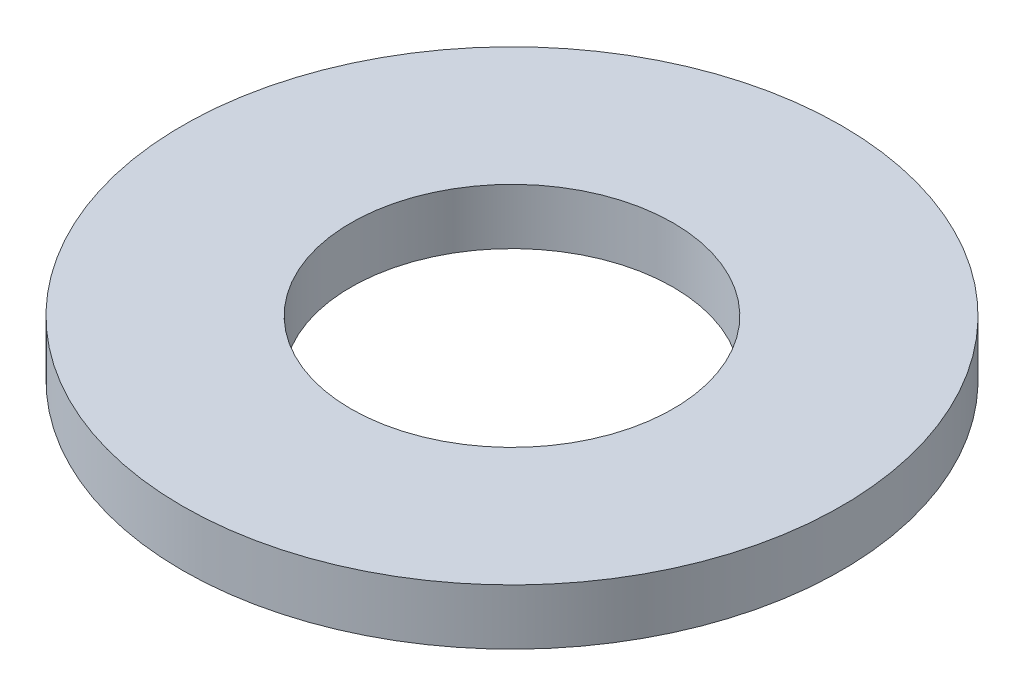
ISO-10303-21;
HEADER;
FILE_DESCRIPTION(('STEP AP214'),'2;1');
FILE_NAME('part.step','',(''),(''),'','','');
FILE_SCHEMA(('AUTOMOTIVE_DESIGN { 1 0 10303 214 1 1 1 1 }'));
ENDSEC;
DATA;
#1=APPLICATION_CONTEXT('core data for automotive mechanical design processes');
#2=APPLICATION_PROTOCOL_DEFINITION('international standard','automotive_design',2000,#1);
#3=PRODUCT_CONTEXT('',#1,'mechanical');
#4=PRODUCT('Part','Part','',(#3));
#5=PRODUCT_RELATED_PRODUCT_CATEGORY('part','',(#4));
#6=PRODUCT_DEFINITION_FORMATION('','',#4);
#7=PRODUCT_DEFINITION_CONTEXT('part definition',#1,'design');
#8=PRODUCT_DEFINITION('design','',#6,#7);
#9=PRODUCT_DEFINITION_SHAPE('','',#8);
#10=(LENGTH_UNIT() NAMED_UNIT(*) SI_UNIT(.MILLI.,.METRE.));
#11=(NAMED_UNIT(*) PLANE_ANGLE_UNIT() SI_UNIT($,.RADIAN.));
#12=(NAMED_UNIT(*) SI_UNIT($,.STERADIAN.) SOLID_ANGLE_UNIT());
#13=UNCERTAINTY_MEASURE_WITH_UNIT(LENGTH_MEASURE(1.E-05),#10,'distance_accuracy_value','');
#14=(GEOMETRIC_REPRESENTATION_CONTEXT(3) GLOBAL_UNCERTAINTY_ASSIGNED_CONTEXT((#13)) GLOBAL_UNIT_ASSIGNED_CONTEXT((#10,
#11,#12)) REPRESENTATION_CONTEXT('',''));
#15=CARTESIAN_POINT('',(0.,0.,0.));
#16=DIRECTION('',(0.,0.,1.));
#17=DIRECTION('',(1.,0.,0.));
#18=AXIS2_PLACEMENT_3D('',#15,#16,#17);
#19=CARTESIAN_POINT('',(0.,0.76,0.));
#20=DIRECTION('',(0.,1.,0.));
#21=DIRECTION('',(0.,0.,1.));
#22=AXIS2_PLACEMENT_3D('',#19,#20,#21);
#23=PLANE('',#22);
#24=CARTESIAN_POINT('',(0.,0.76,0.));
#25=DIRECTION('',(0.,1.,0.));
#26=DIRECTION('',(0.,0.,1.));
#27=AXIS2_PLACEMENT_3D('',#24,#25,#26);
#28=CIRCLE('',#27,4.5);
#29=CARTESIAN_POINT('',(0.,0.76,4.5));
#30=VERTEX_POINT('',#29);
#31=EDGE_CURVE('E10',#30,#30,#28,.T.);
#32=ORIENTED_EDGE('',*,*,#31,.T.);
#33=EDGE_LOOP('',(#32));
#34=FACE_BOUND('',#33,.T.);
#35=CARTESIAN_POINT('',(0.,0.76,0.));
#36=DIRECTION('',(0.,1.,0.));
#37=DIRECTION('',(0.,0.,1.));
#38=AXIS2_PLACEMENT_3D('',#35,#36,#37);
#39=CIRCLE('',#38,2.2);
#40=CARTESIAN_POINT('',(0.,0.76,2.2));
#41=VERTEX_POINT('',#40);
#42=EDGE_CURVE('E48',#41,#41,#39,.T.);
#43=ORIENTED_EDGE('',*,*,#42,.F.);
#44=EDGE_LOOP('',(#43));
#45=FACE_BOUND('',#44,.T.);
#46=ADVANCED_FACE('F37',(#34,#45),#23,.T.);
#47=CARTESIAN_POINT('',(0.,0.,0.));
#48=DIRECTION('',(0.,1.,0.));
#49=DIRECTION('',(0.,0.,1.));
#50=AXIS2_PLACEMENT_3D('',#47,#48,#49);
#51=PLANE('',#50);
#52=CARTESIAN_POINT('',(0.,0.,0.));
#53=DIRECTION('',(0.,1.,0.));
#54=DIRECTION('',(0.,0.,1.));
#55=AXIS2_PLACEMENT_3D('',#52,#53,#54);
#56=CIRCLE('',#55,4.5);
#57=CARTESIAN_POINT('',(0.,0.,4.5));
#58=VERTEX_POINT('',#57);
#59=EDGE_CURVE('E41',#58,#58,#56,.T.);
#60=ORIENTED_EDGE('',*,*,#59,.F.);
#61=EDGE_LOOP('',(#60));
#62=FACE_BOUND('',#61,.T.);
#63=CARTESIAN_POINT('',(0.,0.,0.));
#64=DIRECTION('',(0.,1.,0.));
#65=DIRECTION('',(0.,0.,1.));
#66=AXIS2_PLACEMENT_3D('',#63,#64,#65);
#67=CIRCLE('',#66,2.2);
#68=CARTESIAN_POINT('',(0.,0.,2.2));
#69=VERTEX_POINT('',#68);
#70=EDGE_CURVE('E50',#69,#69,#67,.T.);
#71=ORIENTED_EDGE('',*,*,#70,.T.);
#72=EDGE_LOOP('',(#71));
#73=FACE_BOUND('',#72,.T.);
#74=ADVANCED_FACE('F60',(#62,#73),#51,.F.);
#75=CARTESIAN_POINT('',(0.,0.76,0.));
#76=DIRECTION('',(0.,-1.,0.));
#77=DIRECTION('',(0.,0.,-1.));
#78=AXIS2_PLACEMENT_3D('',#75,#76,#77);
#79=CYLINDRICAL_SURFACE('',#78,4.5);
#80=ORIENTED_EDGE('',*,*,#31,.F.);
#81=EDGE_LOOP('',(#80));
#82=FACE_BOUND('',#81,.T.);
#83=ORIENTED_EDGE('',*,*,#59,.T.);
#84=EDGE_LOOP('',(#83));
#85=FACE_BOUND('',#84,.T.);
#86=ADVANCED_FACE('F39',(#82,#85),#79,.T.);
#87=CARTESIAN_POINT('',(0.,0.76,0.));
#88=DIRECTION('',(0.,-1.,0.));
#89=DIRECTION('',(0.,0.,-1.));
#90=AXIS2_PLACEMENT_3D('',#87,#88,#89);
#91=CYLINDRICAL_SURFACE('',#90,2.2);
#92=ORIENTED_EDGE('',*,*,#42,.T.);
#93=EDGE_LOOP('',(#92));
#94=FACE_BOUND('',#93,.T.);
#95=ORIENTED_EDGE('',*,*,#70,.F.);
#96=EDGE_LOOP('',(#95));
#97=FACE_BOUND('',#96,.T.);
#98=ADVANCED_FACE('F56',(#94,#97),#91,.F.);
#99=CLOSED_SHELL('',(#46,#74,#86,#98));
#100=MANIFOLD_SOLID_BREP('B2',#99);
#101=ADVANCED_BREP_SHAPE_REPRESENTATION('',(#18,#100),#14);
#102=SHAPE_DEFINITION_REPRESENTATION(#9,#101);
ENDSEC;
END-ISO-10303-21;
